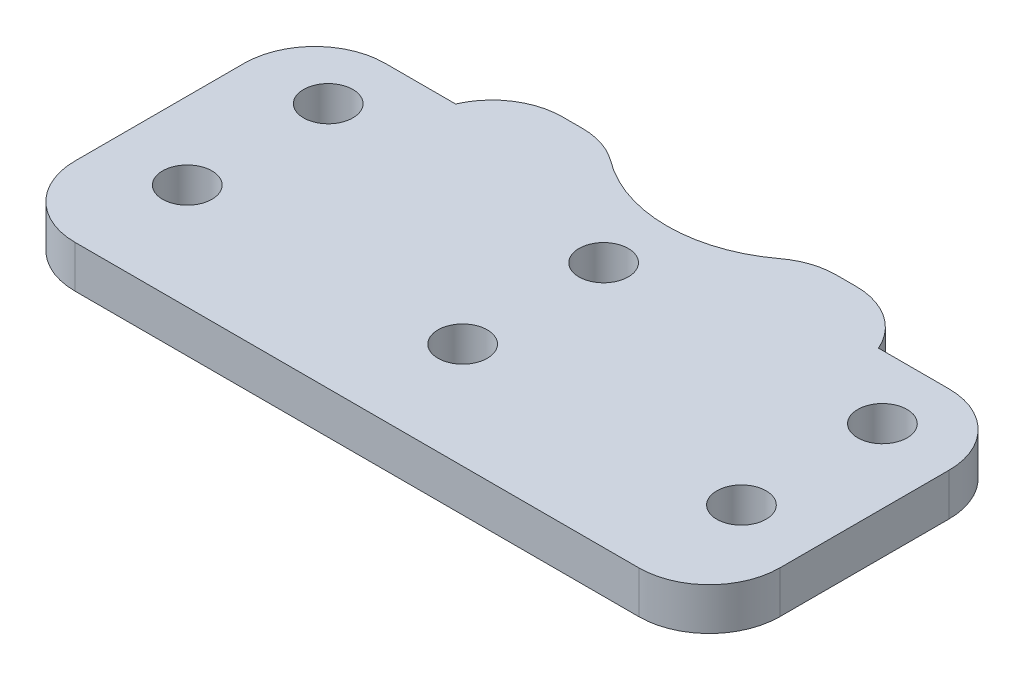
ISO-10303-21;
HEADER;
FILE_DESCRIPTION(('STEP AP214'),'2;1');
FILE_NAME('part.step','',(''),(''),'','','');
FILE_SCHEMA(('AUTOMOTIVE_DESIGN { 1 0 10303 214 1 1 1 1 }'));
ENDSEC;
DATA;
#1=APPLICATION_CONTEXT('core data for automotive mechanical design processes');
#2=APPLICATION_PROTOCOL_DEFINITION('international standard','automotive_design',2000,#1);
#3=PRODUCT_CONTEXT('',#1,'mechanical');
#4=PRODUCT('Part','Part','',(#3));
#5=PRODUCT_RELATED_PRODUCT_CATEGORY('part','',(#4));
#6=PRODUCT_DEFINITION_FORMATION('','',#4);
#7=PRODUCT_DEFINITION_CONTEXT('part definition',#1,'design');
#8=PRODUCT_DEFINITION('design','',#6,#7);
#9=PRODUCT_DEFINITION_SHAPE('','',#8);
#10=(LENGTH_UNIT() NAMED_UNIT(*) SI_UNIT(.MILLI.,.METRE.));
#11=(NAMED_UNIT(*) PLANE_ANGLE_UNIT() SI_UNIT($,.RADIAN.));
#12=(NAMED_UNIT(*) SI_UNIT($,.STERADIAN.) SOLID_ANGLE_UNIT());
#13=UNCERTAINTY_MEASURE_WITH_UNIT(LENGTH_MEASURE(1.E-05),#10,'distance_accuracy_value','');
#14=(GEOMETRIC_REPRESENTATION_CONTEXT(3) GLOBAL_UNCERTAINTY_ASSIGNED_CONTEXT((#13)) GLOBAL_UNIT_ASSIGNED_CONTEXT((#10,
#11,#12)) REPRESENTATION_CONTEXT('',''));
#15=CARTESIAN_POINT('',(0.,0.,0.));
#16=DIRECTION('',(0.,0.,1.));
#17=DIRECTION('',(1.,0.,0.));
#18=AXIS2_PLACEMENT_3D('',#15,#16,#17);
#19=CARTESIAN_POINT('',(0.,3.,-25.));
#20=DIRECTION('',(0.,0.,1.));
#21=DIRECTION('',(1.,0.,0.));
#22=AXIS2_PLACEMENT_3D('',#19,#20,#21);
#23=PLANE('',#22);
#24=DIRECTION('',(-1.,0.,0.));
#25=VECTOR('',#24,1.);
#26=CARTESIAN_POINT('',(0.,0.,-25.));
#27=LINE('',#26,#25);
#28=CARTESIAN_POINT('',(35.4174243050442,0.,-25.));
#29=VERTEX_POINT('',#28);
#30=CARTESIAN_POINT('',(34.,0.,-25.));
#31=VERTEX_POINT('',#30);
#32=EDGE_CURVE('E229',#29,#31,#27,.T.);
#33=ORIENTED_EDGE('',*,*,#32,.T.);
#34=DIRECTION('',(0.,1.,0.));
#35=VECTOR('',#34,1.);
#36=CARTESIAN_POINT('',(34.,3.,-25.));
#37=LINE('',#36,#35);
#38=CARTESIAN_POINT('',(34.,3.,-25.));
#39=VERTEX_POINT('',#38);
#40=EDGE_CURVE('E250',#31,#39,#37,.T.);
#41=ORIENTED_EDGE('',*,*,#40,.T.);
#42=DIRECTION('',(-1.,0.,0.));
#43=VECTOR('',#42,1.);
#44=CARTESIAN_POINT('',(0.,3.,-25.));
#45=LINE('',#44,#43);
#46=CARTESIAN_POINT('',(35.4174243050442,3.,-25.));
#47=VERTEX_POINT('',#46);
#48=EDGE_CURVE('E236',#47,#39,#45,.T.);
#49=ORIENTED_EDGE('',*,*,#48,.F.);
#50=DIRECTION('',(0.,1.,0.));
#51=VECTOR('',#50,1.);
#52=CARTESIAN_POINT('',(35.4174243050442,3.,-25.));
#53=LINE('',#52,#51);
#54=EDGE_CURVE('E247',#47,#29,#53,.F.);
#55=ORIENTED_EDGE('',*,*,#54,.T.);
#56=EDGE_LOOP('',(#33,#41,#49,#55));
#57=FACE_BOUND('',#56,.T.);
#58=ADVANCED_FACE('F32',(#57),#23,.F.);
#59=CARTESIAN_POINT('',(0.,3.,0.));
#60=DIRECTION('',(0.,-1.,0.));
#61=DIRECTION('',(0.,0.,-1.));
#62=AXIS2_PLACEMENT_3D('',#59,#60,#61);
#63=PLANE('',#62);
#64=ORIENTED_EDGE('',*,*,#48,.T.);
#65=CARTESIAN_POINT('',(34.,3.,-20.));
#66=DIRECTION('',(0.,-1.,0.));
#67=DIRECTION('',(0.,0.,-1.));
#68=AXIS2_PLACEMENT_3D('',#65,#66,#67);
#69=CIRCLE('',#68,5.);
#70=CARTESIAN_POINT('',(31.,3.,-24.));
#71=VERTEX_POINT('',#70);
#72=EDGE_CURVE('E263',#39,#71,#69,.F.);
#73=ORIENTED_EDGE('',*,*,#72,.T.);
#74=CARTESIAN_POINT('',(25.,3.,-32.));
#75=DIRECTION('',(0.,1.,0.));
#76=DIRECTION('',(0.,0.,1.));
#77=AXIS2_PLACEMENT_3D('',#74,#75,#76);
#78=CIRCLE('',#77,10.);
#79=CARTESIAN_POINT('',(19.,3.,-24.));
#80=VERTEX_POINT('',#79);
#81=EDGE_CURVE('E180',#80,#71,#78,.T.);
#82=ORIENTED_EDGE('',*,*,#81,.F.);
#83=CARTESIAN_POINT('',(16.,3.,-20.));
#84=DIRECTION('',(0.,-1.,0.));
#85=DIRECTION('',(0.,0.,-1.));
#86=AXIS2_PLACEMENT_3D('',#83,#84,#85);
#87=CIRCLE('',#86,5.);
#88=CARTESIAN_POINT('',(16.,3.,-25.));
#89=VERTEX_POINT('',#88);
#90=EDGE_CURVE('E261',#80,#89,#87,.F.);
#91=ORIENTED_EDGE('',*,*,#90,.T.);
#92=CARTESIAN_POINT('',(14.5825756949558,3.,-25.));
#93=VERTEX_POINT('',#92);
#94=EDGE_CURVE('E152',#89,#93,#45,.T.);
#95=ORIENTED_EDGE('',*,*,#94,.T.);
#96=CARTESIAN_POINT('',(14.5825756949558,3.,-20.));
#97=DIRECTION('',(0.,-1.,0.));
#98=DIRECTION('',(0.,0.,-1.));
#99=AXIS2_PLACEMENT_3D('',#96,#97,#98);
#100=CIRCLE('',#99,5.);
#101=CARTESIAN_POINT('',(10.,3.,-22.));
#102=VERTEX_POINT('',#101);
#103=EDGE_CURVE('E145',#93,#102,#100,.F.);
#104=ORIENTED_EDGE('',*,*,#103,.T.);
#105=DIRECTION('',(1.,0.,0.));
#106=VECTOR('',#105,1.);
#107=CARTESIAN_POINT('',(0.,3.,-22.));
#108=LINE('',#107,#106);
#109=CARTESIAN_POINT('',(5.,3.,-22.));
#110=VERTEX_POINT('',#109);
#111=EDGE_CURVE('E150',#110,#102,#108,.T.);
#112=ORIENTED_EDGE('',*,*,#111,.F.);
#113=CARTESIAN_POINT('',(5.,3.,-17.));
#114=DIRECTION('',(0.,-1.,0.));
#115=DIRECTION('',(0.,0.,-1.));
#116=AXIS2_PLACEMENT_3D('',#113,#114,#115);
#117=CIRCLE('',#116,5.);
#118=CARTESIAN_POINT('',(0.,3.,-17.));
#119=VERTEX_POINT('',#118);
#120=EDGE_CURVE('E158',#110,#119,#117,.F.);
#121=ORIENTED_EDGE('',*,*,#120,.T.);
#122=DIRECTION('',(0.,0.,1.));
#123=VECTOR('',#122,1.);
#124=CARTESIAN_POINT('',(0.,3.,0.));
#125=LINE('',#124,#123);
#126=CARTESIAN_POINT('',(0.,3.,-5.));
#127=VERTEX_POINT('',#126);
#128=EDGE_CURVE('E225',#119,#127,#125,.T.);
#129=ORIENTED_EDGE('',*,*,#128,.T.);
#130=CARTESIAN_POINT('',(5.,3.,-5.));
#131=DIRECTION('',(0.,-1.,0.));
#132=DIRECTION('',(0.,0.,-1.));
#133=AXIS2_PLACEMENT_3D('',#130,#131,#132);
#134=CIRCLE('',#133,5.);
#135=CARTESIAN_POINT('',(5.,3.,0.));
#136=VERTEX_POINT('',#135);
#137=EDGE_CURVE('E253',#127,#136,#134,.F.);
#138=ORIENTED_EDGE('',*,*,#137,.T.);
#139=DIRECTION('',(1.,0.,0.));
#140=VECTOR('',#139,1.);
#141=CARTESIAN_POINT('',(0.,3.,0.));
#142=LINE('',#141,#140);
#143=CARTESIAN_POINT('',(45.,3.,0.));
#144=VERTEX_POINT('',#143);
#145=EDGE_CURVE('E228',#136,#144,#142,.T.);
#146=ORIENTED_EDGE('',*,*,#145,.T.);
#147=CARTESIAN_POINT('',(45.,3.,-5.));
#148=DIRECTION('',(0.,-1.,0.));
#149=DIRECTION('',(0.,0.,-1.));
#150=AXIS2_PLACEMENT_3D('',#147,#148,#149);
#151=CIRCLE('',#150,5.);
#152=CARTESIAN_POINT('',(50.,3.,-5.));
#153=VERTEX_POINT('',#152);
#154=EDGE_CURVE('E255',#144,#153,#151,.F.);
#155=ORIENTED_EDGE('',*,*,#154,.T.);
#156=DIRECTION('',(0.,0.,-1.));
#157=VECTOR('',#156,1.);
#158=CARTESIAN_POINT('',(50.,3.,0.));
#159=LINE('',#158,#157);
#160=CARTESIAN_POINT('',(50.,3.,-17.));
#161=VERTEX_POINT('',#160);
#162=EDGE_CURVE('E232',#153,#161,#159,.T.);
#163=ORIENTED_EDGE('',*,*,#162,.T.);
#164=CARTESIAN_POINT('',(45.,3.,-17.));
#165=DIRECTION('',(0.,-1.,0.));
#166=DIRECTION('',(0.,0.,-1.));
#167=AXIS2_PLACEMENT_3D('',#164,#165,#166);
#168=CIRCLE('',#167,5.);
#169=CARTESIAN_POINT('',(45.,3.,-22.));
#170=VERTEX_POINT('',#169);
#171=EDGE_CURVE('E259',#161,#170,#168,.F.);
#172=ORIENTED_EDGE('',*,*,#171,.T.);
#173=DIRECTION('',(1.,0.,0.));
#174=VECTOR('',#173,1.);
#175=CARTESIAN_POINT('',(50.,3.,-22.));
#176=LINE('',#175,#174);
#177=CARTESIAN_POINT('',(40.,3.,-22.));
#178=VERTEX_POINT('',#177);
#179=EDGE_CURVE('E177',#178,#170,#176,.T.);
#180=ORIENTED_EDGE('',*,*,#179,.F.);
#181=CARTESIAN_POINT('',(35.4174243050442,3.,-20.));
#182=DIRECTION('',(0.,-1.,0.));
#183=DIRECTION('',(0.,0.,-1.));
#184=AXIS2_PLACEMENT_3D('',#181,#182,#183);
#185=CIRCLE('',#184,5.);
#186=EDGE_CURVE('E157',#178,#47,#185,.F.);
#187=ORIENTED_EDGE('',*,*,#186,.T.);
#188=EDGE_LOOP('',(#64,#73,#82,#91,#95,#104,#112,#121,#129,#138,#146,#155,#163,#172,#180,#187));
#189=FACE_BOUND('',#188,.T.);
#190=CARTESIAN_POINT('',(25.,3.,-17.5));
#191=DIRECTION('',(0.,1.,0.));
#192=DIRECTION('',(0.,0.,1.));
#193=AXIS2_PLACEMENT_3D('',#190,#191,#192);
#194=CIRCLE('',#193,1.75);
#195=CARTESIAN_POINT('',(25.,3.,-15.75));
#196=VERTEX_POINT('',#195);
#197=EDGE_CURVE('E219',#196,#196,#194,.T.);
#198=ORIENTED_EDGE('',*,*,#197,.F.);
#199=EDGE_LOOP('',(#198));
#200=FACE_BOUND('',#199,.T.);
#201=CARTESIAN_POINT('',(25.,3.,-7.5));
#202=DIRECTION('',(0.,1.,0.));
#203=DIRECTION('',(0.,0.,1.));
#204=AXIS2_PLACEMENT_3D('',#201,#202,#203);
#205=CIRCLE('',#204,1.75);
#206=CARTESIAN_POINT('',(25.,3.,-5.75));
#207=VERTEX_POINT('',#206);
#208=EDGE_CURVE('E213',#207,#207,#205,.T.);
#209=ORIENTED_EDGE('',*,*,#208,.F.);
#210=EDGE_LOOP('',(#209));
#211=FACE_BOUND('',#210,.T.);
#212=CARTESIAN_POINT('',(5.46323670634306,3.,-17.5));
#213=DIRECTION('',(0.,1.,0.));
#214=DIRECTION('',(0.,0.,1.));
#215=AXIS2_PLACEMENT_3D('',#212,#213,#214);
#216=CIRCLE('',#215,1.75);
#217=CARTESIAN_POINT('',(5.46323670634306,3.,-15.75));
#218=VERTEX_POINT('',#217);
#219=EDGE_CURVE('E207',#218,#218,#216,.T.);
#220=ORIENTED_EDGE('',*,*,#219,.F.);
#221=EDGE_LOOP('',(#220));
#222=FACE_BOUND('',#221,.T.);
#223=CARTESIAN_POINT('',(5.46323670634306,3.,-7.5));
#224=DIRECTION('',(0.,1.,0.));
#225=DIRECTION('',(0.,0.,1.));
#226=AXIS2_PLACEMENT_3D('',#223,#224,#225);
#227=CIRCLE('',#226,1.75);
#228=CARTESIAN_POINT('',(5.46323670634306,3.,-5.75));
#229=VERTEX_POINT('',#228);
#230=EDGE_CURVE('E201',#229,#229,#227,.T.);
#231=ORIENTED_EDGE('',*,*,#230,.F.);
#232=EDGE_LOOP('',(#231));
#233=FACE_BOUND('',#232,.T.);
#234=CARTESIAN_POINT('',(44.7775700267946,3.,-7.5));
#235=DIRECTION('',(0.,1.,0.));
#236=DIRECTION('',(0.,0.,1.));
#237=AXIS2_PLACEMENT_3D('',#234,#235,#236);
#238=CIRCLE('',#237,1.75);
#239=CARTESIAN_POINT('',(44.7775700267946,3.,-5.75));
#240=VERTEX_POINT('',#239);
#241=EDGE_CURVE('E195',#240,#240,#238,.T.);
#242=ORIENTED_EDGE('',*,*,#241,.F.);
#243=EDGE_LOOP('',(#242));
#244=FACE_BOUND('',#243,.T.);
#245=CARTESIAN_POINT('',(44.7775700267946,3.,-17.5));
#246=DIRECTION('',(0.,1.,0.));
#247=DIRECTION('',(0.,0.,1.));
#248=AXIS2_PLACEMENT_3D('',#245,#246,#247);
#249=CIRCLE('',#248,1.75);
#250=CARTESIAN_POINT('',(44.7775700267946,3.,-15.75));
#251=VERTEX_POINT('',#250);
#252=EDGE_CURVE('E189',#251,#251,#249,.T.);
#253=ORIENTED_EDGE('',*,*,#252,.F.);
#254=EDGE_LOOP('',(#253));
#255=FACE_BOUND('',#254,.T.);
#256=ADVANCED_FACE('F148',(#189,#200,#211,#222,#233,#244,#255),#63,.F.);
#257=CARTESIAN_POINT('',(0.,0.,0.));
#258=DIRECTION('',(0.,-1.,0.));
#259=DIRECTION('',(0.,0.,-1.));
#260=AXIS2_PLACEMENT_3D('',#257,#258,#259);
#261=PLANE('',#260);
#262=CARTESIAN_POINT('',(25.,0.,-32.));
#263=DIRECTION('',(0.,-1.,0.));
#264=DIRECTION('',(0.,0.,-1.));
#265=AXIS2_PLACEMENT_3D('',#262,#263,#264);
#266=CIRCLE('',#265,10.);
#267=CARTESIAN_POINT('',(31.,0.,-24.));
#268=VERTEX_POINT('',#267);
#269=CARTESIAN_POINT('',(19.,0.,-24.));
#270=VERTEX_POINT('',#269);
#271=EDGE_CURVE('E171',#268,#270,#266,.T.);
#272=ORIENTED_EDGE('',*,*,#271,.F.);
#273=CARTESIAN_POINT('',(34.,0.,-20.));
#274=DIRECTION('',(0.,-1.,0.));
#275=DIRECTION('',(0.,0.,-1.));
#276=AXIS2_PLACEMENT_3D('',#273,#274,#275);
#277=CIRCLE('',#276,5.);
#278=EDGE_CURVE('E280',#268,#31,#277,.T.);
#279=ORIENTED_EDGE('',*,*,#278,.T.);
#280=ORIENTED_EDGE('',*,*,#32,.F.);
#281=CARTESIAN_POINT('',(35.4174243050442,0.,-20.));
#282=DIRECTION('',(0.,-1.,0.));
#283=DIRECTION('',(0.,0.,-1.));
#284=AXIS2_PLACEMENT_3D('',#281,#282,#283);
#285=CIRCLE('',#284,5.);
#286=CARTESIAN_POINT('',(40.,0.,-22.));
#287=VERTEX_POINT('',#286);
#288=EDGE_CURVE('E274',#29,#287,#285,.T.);
#289=ORIENTED_EDGE('',*,*,#288,.T.);
#290=DIRECTION('',(-1.,0.,0.));
#291=VECTOR('',#290,1.);
#292=CARTESIAN_POINT('',(0.,0.,-22.));
#293=LINE('',#292,#291);
#294=CARTESIAN_POINT('',(45.,0.,-22.));
#295=VERTEX_POINT('',#294);
#296=EDGE_CURVE('E174',#295,#287,#293,.T.);
#297=ORIENTED_EDGE('',*,*,#296,.F.);
#298=CARTESIAN_POINT('',(45.,0.,-17.));
#299=DIRECTION('',(0.,-1.,0.));
#300=DIRECTION('',(0.,0.,-1.));
#301=AXIS2_PLACEMENT_3D('',#298,#299,#300);
#302=CIRCLE('',#301,5.);
#303=CARTESIAN_POINT('',(50.,0.,-17.));
#304=VERTEX_POINT('',#303);
#305=EDGE_CURVE('E276',#295,#304,#302,.T.);
#306=ORIENTED_EDGE('',*,*,#305,.T.);
#307=DIRECTION('',(0.,0.,-1.));
#308=VECTOR('',#307,1.);
#309=CARTESIAN_POINT('',(50.,0.,0.));
#310=LINE('',#309,#308);
#311=CARTESIAN_POINT('',(50.,0.,-5.));
#312=VERTEX_POINT('',#311);
#313=EDGE_CURVE('E241',#312,#304,#310,.T.);
#314=ORIENTED_EDGE('',*,*,#313,.F.);
#315=CARTESIAN_POINT('',(45.,0.,-5.));
#316=DIRECTION('',(0.,-1.,0.));
#317=DIRECTION('',(0.,0.,-1.));
#318=AXIS2_PLACEMENT_3D('',#315,#316,#317);
#319=CIRCLE('',#318,5.);
#320=CARTESIAN_POINT('',(45.,0.,0.));
#321=VERTEX_POINT('',#320);
#322=EDGE_CURVE('E270',#312,#321,#319,.T.);
#323=ORIENTED_EDGE('',*,*,#322,.T.);
#324=DIRECTION('',(1.,0.,0.));
#325=VECTOR('',#324,1.);
#326=CARTESIAN_POINT('',(0.,0.,0.));
#327=LINE('',#326,#325);
#328=CARTESIAN_POINT('',(5.,0.,0.));
#329=VERTEX_POINT('',#328);
#330=EDGE_CURVE('E238',#329,#321,#327,.T.);
#331=ORIENTED_EDGE('',*,*,#330,.F.);
#332=CARTESIAN_POINT('',(5.,0.,-5.));
#333=DIRECTION('',(0.,-1.,0.));
#334=DIRECTION('',(0.,0.,-1.));
#335=AXIS2_PLACEMENT_3D('',#332,#333,#334);
#336=CIRCLE('',#335,5.);
#337=CARTESIAN_POINT('',(0.,0.,-5.));
#338=VERTEX_POINT('',#337);
#339=EDGE_CURVE('E53',#329,#338,#336,.T.);
#340=ORIENTED_EDGE('',*,*,#339,.T.);
#341=DIRECTION('',(0.,0.,1.));
#342=VECTOR('',#341,1.);
#343=CARTESIAN_POINT('',(0.,0.,0.));
#344=LINE('',#343,#342);
#345=CARTESIAN_POINT('',(0.,0.,-17.));
#346=VERTEX_POINT('',#345);
#347=EDGE_CURVE('E222',#346,#338,#344,.T.);
#348=ORIENTED_EDGE('',*,*,#347,.F.);
#349=CARTESIAN_POINT('',(5.,0.,-17.));
#350=DIRECTION('',(0.,-1.,0.));
#351=DIRECTION('',(0.,0.,-1.));
#352=AXIS2_PLACEMENT_3D('',#349,#350,#351);
#353=CIRCLE('',#352,5.);
#354=CARTESIAN_POINT('',(5.,0.,-22.));
#355=VERTEX_POINT('',#354);
#356=EDGE_CURVE('E47',#346,#355,#353,.T.);
#357=ORIENTED_EDGE('',*,*,#356,.T.);
#358=DIRECTION('',(-1.,0.,0.));
#359=VECTOR('',#358,1.);
#360=CARTESIAN_POINT('',(0.,0.,-22.));
#361=LINE('',#360,#359);
#362=CARTESIAN_POINT('',(10.,0.,-22.));
#363=VERTEX_POINT('',#362);
#364=EDGE_CURVE('E186',#363,#355,#361,.T.);
#365=ORIENTED_EDGE('',*,*,#364,.F.);
#366=CARTESIAN_POINT('',(14.5825756949558,0.,-20.));
#367=DIRECTION('',(0.,-1.,0.));
#368=DIRECTION('',(0.,0.,-1.));
#369=AXIS2_PLACEMENT_3D('',#366,#367,#368);
#370=CIRCLE('',#369,5.);
#371=CARTESIAN_POINT('',(14.5825756949558,0.,-25.));
#372=VERTEX_POINT('',#371);
#373=EDGE_CURVE('E170',#363,#372,#370,.T.);
#374=ORIENTED_EDGE('',*,*,#373,.T.);
#375=CARTESIAN_POINT('',(16.,0.,-25.));
#376=VERTEX_POINT('',#375);
#377=EDGE_CURVE('E244',#376,#372,#27,.T.);
#378=ORIENTED_EDGE('',*,*,#377,.F.);
#379=CARTESIAN_POINT('',(16.,0.,-20.));
#380=DIRECTION('',(0.,-1.,0.));
#381=DIRECTION('',(0.,0.,-1.));
#382=AXIS2_PLACEMENT_3D('',#379,#380,#381);
#383=CIRCLE('',#382,5.);
#384=EDGE_CURVE('E278',#376,#270,#383,.T.);
#385=ORIENTED_EDGE('',*,*,#384,.T.);
#386=EDGE_LOOP('',(#272,#279,#280,#289,#297,#306,#314,#323,#331,#340,#348,#357,#365,#374,#378,#385));
#387=FACE_BOUND('',#386,.T.);
#388=CARTESIAN_POINT('',(44.7775700267946,0.,-7.5));
#389=DIRECTION('',(0.,1.,0.));
#390=DIRECTION('',(0.,0.,1.));
#391=AXIS2_PLACEMENT_3D('',#388,#389,#390);
#392=CIRCLE('',#391,1.75);
#393=CARTESIAN_POINT('',(44.7775700267946,0.,-5.75));
#394=VERTEX_POINT('',#393);
#395=EDGE_CURVE('E192',#394,#394,#392,.T.);
#396=ORIENTED_EDGE('',*,*,#395,.T.);
#397=EDGE_LOOP('',(#396));
#398=FACE_BOUND('',#397,.T.);
#399=CARTESIAN_POINT('',(5.46323670634306,0.,-17.5));
#400=DIRECTION('',(0.,1.,0.));
#401=DIRECTION('',(0.,0.,1.));
#402=AXIS2_PLACEMENT_3D('',#399,#400,#401);
#403=CIRCLE('',#402,1.75);
#404=CARTESIAN_POINT('',(5.46323670634306,0.,-15.75));
#405=VERTEX_POINT('',#404);
#406=EDGE_CURVE('E204',#405,#405,#403,.T.);
#407=ORIENTED_EDGE('',*,*,#406,.T.);
#408=EDGE_LOOP('',(#407));
#409=FACE_BOUND('',#408,.T.);
#410=CARTESIAN_POINT('',(25.,0.,-17.5));
#411=DIRECTION('',(0.,1.,0.));
#412=DIRECTION('',(0.,0.,1.));
#413=AXIS2_PLACEMENT_3D('',#410,#411,#412);
#414=CIRCLE('',#413,1.75);
#415=CARTESIAN_POINT('',(25.,0.,-15.75));
#416=VERTEX_POINT('',#415);
#417=EDGE_CURVE('E216',#416,#416,#414,.T.);
#418=ORIENTED_EDGE('',*,*,#417,.T.);
#419=EDGE_LOOP('',(#418));
#420=FACE_BOUND('',#419,.T.);
#421=CARTESIAN_POINT('',(25.,0.,-7.5));
#422=DIRECTION('',(0.,1.,0.));
#423=DIRECTION('',(0.,0.,1.));
#424=AXIS2_PLACEMENT_3D('',#421,#422,#423);
#425=CIRCLE('',#424,1.75);
#426=CARTESIAN_POINT('',(25.,0.,-5.75));
#427=VERTEX_POINT('',#426);
#428=EDGE_CURVE('E210',#427,#427,#425,.T.);
#429=ORIENTED_EDGE('',*,*,#428,.T.);
#430=EDGE_LOOP('',(#429));
#431=FACE_BOUND('',#430,.T.);
#432=CARTESIAN_POINT('',(5.46323670634306,0.,-7.5));
#433=DIRECTION('',(0.,1.,0.));
#434=DIRECTION('',(0.,0.,1.));
#435=AXIS2_PLACEMENT_3D('',#432,#433,#434);
#436=CIRCLE('',#435,1.75);
#437=CARTESIAN_POINT('',(5.46323670634306,0.,-5.75));
#438=VERTEX_POINT('',#437);
#439=EDGE_CURVE('E198',#438,#438,#436,.T.);
#440=ORIENTED_EDGE('',*,*,#439,.T.);
#441=EDGE_LOOP('',(#440));
#442=FACE_BOUND('',#441,.T.);
#443=CARTESIAN_POINT('',(44.7775700267946,0.,-17.5));
#444=DIRECTION('',(0.,1.,0.));
#445=DIRECTION('',(0.,0.,1.));
#446=AXIS2_PLACEMENT_3D('',#443,#444,#445);
#447=CIRCLE('',#446,1.75);
#448=CARTESIAN_POINT('',(44.7775700267946,0.,-15.75));
#449=VERTEX_POINT('',#448);
#450=EDGE_CURVE('E188',#449,#449,#447,.T.);
#451=ORIENTED_EDGE('',*,*,#450,.T.);
#452=EDGE_LOOP('',(#451));
#453=FACE_BOUND('',#452,.T.);
#454=ADVANCED_FACE('F308',(#387,#398,#409,#420,#431,#442,#453),#261,.T.);
#455=CARTESIAN_POINT('',(0.,3.,0.));
#456=DIRECTION('',(1.,0.,0.));
#457=DIRECTION('',(0.,0.,-1.));
#458=AXIS2_PLACEMENT_3D('',#455,#456,#457);
#459=PLANE('',#458);
#460=ORIENTED_EDGE('',*,*,#128,.F.);
#461=DIRECTION('',(0.,1.,0.));
#462=VECTOR('',#461,1.);
#463=CARTESIAN_POINT('',(0.,3.,-17.));
#464=LINE('',#463,#462);
#465=EDGE_CURVE('E298',#119,#346,#464,.F.);
#466=ORIENTED_EDGE('',*,*,#465,.T.);
#467=ORIENTED_EDGE('',*,*,#347,.T.);
#468=DIRECTION('',(0.,-1.,0.));
#469=VECTOR('',#468,1.);
#470=CARTESIAN_POINT('',(0.,3.,-5.));
#471=LINE('',#470,#469);
#472=EDGE_CURVE('E296',#338,#127,#471,.F.);
#473=ORIENTED_EDGE('',*,*,#472,.T.);
#474=EDGE_LOOP('',(#460,#466,#467,#473));
#475=FACE_BOUND('',#474,.T.);
#476=ADVANCED_FACE('F323',(#475),#459,.F.);
#477=CARTESIAN_POINT('',(0.,3.,0.));
#478=DIRECTION('',(0.,0.,-1.));
#479=DIRECTION('',(-1.,0.,0.));
#480=AXIS2_PLACEMENT_3D('',#477,#478,#479);
#481=PLANE('',#480);
#482=ORIENTED_EDGE('',*,*,#330,.T.);
#483=DIRECTION('',(0.,-1.,0.));
#484=VECTOR('',#483,1.);
#485=CARTESIAN_POINT('',(45.,3.,0.));
#486=LINE('',#485,#484);
#487=EDGE_CURVE('E11',#321,#144,#486,.F.);
#488=ORIENTED_EDGE('',*,*,#487,.T.);
#489=ORIENTED_EDGE('',*,*,#145,.F.);
#490=DIRECTION('',(0.,-1.,0.));
#491=VECTOR('',#490,1.);
#492=CARTESIAN_POINT('',(5.,3.,0.));
#493=LINE('',#492,#491);
#494=EDGE_CURVE('E40',#136,#329,#493,.T.);
#495=ORIENTED_EDGE('',*,*,#494,.T.);
#496=EDGE_LOOP('',(#482,#488,#489,#495));
#497=FACE_BOUND('',#496,.T.);
#498=ADVANCED_FACE('F303',(#497),#481,.F.);
#499=CARTESIAN_POINT('',(50.,3.,0.));
#500=DIRECTION('',(-1.,0.,0.));
#501=DIRECTION('',(0.,0.,1.));
#502=AXIS2_PLACEMENT_3D('',#499,#500,#501);
#503=PLANE('',#502);
#504=ORIENTED_EDGE('',*,*,#313,.T.);
#505=DIRECTION('',(0.,1.,0.));
#506=VECTOR('',#505,1.);
#507=CARTESIAN_POINT('',(50.,3.,-17.));
#508=LINE('',#507,#506);
#509=EDGE_CURVE('E290',#304,#161,#508,.T.);
#510=ORIENTED_EDGE('',*,*,#509,.T.);
#511=ORIENTED_EDGE('',*,*,#162,.F.);
#512=DIRECTION('',(0.,-1.,0.));
#513=VECTOR('',#512,1.);
#514=CARTESIAN_POINT('',(50.,3.,-5.));
#515=LINE('',#514,#513);
#516=EDGE_CURVE('E287',#153,#312,#515,.T.);
#517=ORIENTED_EDGE('',*,*,#516,.T.);
#518=EDGE_LOOP('',(#504,#510,#511,#517));
#519=FACE_BOUND('',#518,.T.);
#520=ADVANCED_FACE('F317',(#519),#503,.F.);
#521=ORIENTED_EDGE('',*,*,#94,.F.);
#522=DIRECTION('',(0.,1.,0.));
#523=VECTOR('',#522,1.);
#524=CARTESIAN_POINT('',(16.,3.,-25.));
#525=LINE('',#524,#523);
#526=EDGE_CURVE('E284',#89,#376,#525,.F.);
#527=ORIENTED_EDGE('',*,*,#526,.T.);
#528=ORIENTED_EDGE('',*,*,#377,.T.);
#529=DIRECTION('',(0.,-1.,0.));
#530=VECTOR('',#529,1.);
#531=CARTESIAN_POINT('',(14.5825756949558,3.,-25.));
#532=LINE('',#531,#530);
#533=EDGE_CURVE('E282',#372,#93,#532,.F.);
#534=ORIENTED_EDGE('',*,*,#533,.T.);
#535=EDGE_LOOP('',(#521,#527,#528,#534));
#536=FACE_BOUND('',#535,.T.);
#537=ADVANCED_FACE('F338',(#536),#23,.F.);
#538=CARTESIAN_POINT('',(25.,3.,-17.5));
#539=DIRECTION('',(0.,-1.,0.));
#540=DIRECTION('',(0.,0.,-1.));
#541=AXIS2_PLACEMENT_3D('',#538,#539,#540);
#542=CYLINDRICAL_SURFACE('',#541,1.75);
#543=ORIENTED_EDGE('',*,*,#197,.T.);
#544=EDGE_LOOP('',(#543));
#545=FACE_BOUND('',#544,.T.);
#546=ORIENTED_EDGE('',*,*,#417,.F.);
#547=EDGE_LOOP('',(#546));
#548=FACE_BOUND('',#547,.T.);
#549=ADVANCED_FACE('F347',(#545,#548),#542,.F.);
#550=CARTESIAN_POINT('',(25.,3.,-7.5));
#551=DIRECTION('',(0.,-1.,0.));
#552=DIRECTION('',(0.,0.,-1.));
#553=AXIS2_PLACEMENT_3D('',#550,#551,#552);
#554=CYLINDRICAL_SURFACE('',#553,1.75);
#555=ORIENTED_EDGE('',*,*,#208,.T.);
#556=EDGE_LOOP('',(#555));
#557=FACE_BOUND('',#556,.T.);
#558=ORIENTED_EDGE('',*,*,#428,.F.);
#559=EDGE_LOOP('',(#558));
#560=FACE_BOUND('',#559,.T.);
#561=ADVANCED_FACE('F353',(#557,#560),#554,.F.);
#562=CARTESIAN_POINT('',(5.46323670634306,3.,-17.5));
#563=DIRECTION('',(0.,-1.,0.));
#564=DIRECTION('',(0.,0.,-1.));
#565=AXIS2_PLACEMENT_3D('',#562,#563,#564);
#566=CYLINDRICAL_SURFACE('',#565,1.75);
#567=ORIENTED_EDGE('',*,*,#219,.T.);
#568=EDGE_LOOP('',(#567));
#569=FACE_BOUND('',#568,.T.);
#570=ORIENTED_EDGE('',*,*,#406,.F.);
#571=EDGE_LOOP('',(#570));
#572=FACE_BOUND('',#571,.T.);
#573=ADVANCED_FACE('F497',(#569,#572),#566,.F.);
#574=CARTESIAN_POINT('',(5.46323670634306,3.,-7.5));
#575=DIRECTION('',(0.,-1.,0.));
#576=DIRECTION('',(0.,0.,-1.));
#577=AXIS2_PLACEMENT_3D('',#574,#575,#576);
#578=CYLINDRICAL_SURFACE('',#577,1.75);
#579=ORIENTED_EDGE('',*,*,#230,.T.);
#580=EDGE_LOOP('',(#579));
#581=FACE_BOUND('',#580,.T.);
#582=ORIENTED_EDGE('',*,*,#439,.F.);
#583=EDGE_LOOP('',(#582));
#584=FACE_BOUND('',#583,.T.);
#585=ADVANCED_FACE('F493',(#581,#584),#578,.F.);
#586=CARTESIAN_POINT('',(44.7775700267946,3.,-7.5));
#587=DIRECTION('',(0.,-1.,0.));
#588=DIRECTION('',(0.,0.,-1.));
#589=AXIS2_PLACEMENT_3D('',#586,#587,#588);
#590=CYLINDRICAL_SURFACE('',#589,1.75);
#591=ORIENTED_EDGE('',*,*,#241,.T.);
#592=EDGE_LOOP('',(#591));
#593=FACE_BOUND('',#592,.T.);
#594=ORIENTED_EDGE('',*,*,#395,.F.);
#595=EDGE_LOOP('',(#594));
#596=FACE_BOUND('',#595,.T.);
#597=ADVANCED_FACE('F489',(#593,#596),#590,.F.);
#598=CARTESIAN_POINT('',(44.7775700267946,3.,-17.5));
#599=DIRECTION('',(0.,-1.,0.));
#600=DIRECTION('',(0.,0.,-1.));
#601=AXIS2_PLACEMENT_3D('',#598,#599,#600);
#602=CYLINDRICAL_SURFACE('',#601,1.75);
#603=ORIENTED_EDGE('',*,*,#252,.T.);
#604=EDGE_LOOP('',(#603));
#605=FACE_BOUND('',#604,.T.);
#606=ORIENTED_EDGE('',*,*,#450,.F.);
#607=EDGE_LOOP('',(#606));
#608=FACE_BOUND('',#607,.T.);
#609=ADVANCED_FACE('F420',(#605,#608),#602,.F.);
#610=CARTESIAN_POINT('',(25.,-7.,-32.));
#611=DIRECTION('',(0.,1.,0.));
#612=DIRECTION('',(0.,0.,1.));
#613=AXIS2_PLACEMENT_3D('',#610,#611,#612);
#614=CYLINDRICAL_SURFACE('',#613,10.);
#615=ORIENTED_EDGE('',*,*,#81,.T.);
#616=DIRECTION('',(0.,1.,0.));
#617=VECTOR('',#616,1.);
#618=CARTESIAN_POINT('',(31.,-7.,-24.));
#619=LINE('',#618,#617);
#620=EDGE_CURVE('E267',#71,#268,#619,.F.);
#621=ORIENTED_EDGE('',*,*,#620,.T.);
#622=ORIENTED_EDGE('',*,*,#271,.T.);
#623=DIRECTION('',(0.,1.,0.));
#624=VECTOR('',#623,1.);
#625=CARTESIAN_POINT('',(19.,-7.,-24.));
#626=LINE('',#625,#624);
#627=EDGE_CURVE('E265',#270,#80,#626,.T.);
#628=ORIENTED_EDGE('',*,*,#627,.T.);
#629=EDGE_LOOP('',(#615,#621,#622,#628));
#630=FACE_BOUND('',#629,.T.);
#631=ADVANCED_FACE('F364',(#630),#614,.F.);
#632=CARTESIAN_POINT('',(50.,-7.,-22.));
#633=DIRECTION('',(0.,0.,1.));
#634=DIRECTION('',(1.,0.,0.));
#635=AXIS2_PLACEMENT_3D('',#632,#633,#634);
#636=PLANE('',#635);
#637=ORIENTED_EDGE('',*,*,#179,.T.);
#638=DIRECTION('',(0.,1.,0.));
#639=VECTOR('',#638,1.);
#640=CARTESIAN_POINT('',(45.,-7.,-22.));
#641=LINE('',#640,#639);
#642=EDGE_CURVE('E293',#170,#295,#641,.F.);
#643=ORIENTED_EDGE('',*,*,#642,.T.);
#644=ORIENTED_EDGE('',*,*,#296,.T.);
#645=DIRECTION('',(0.,1.,0.));
#646=VECTOR('',#645,1.);
#647=CARTESIAN_POINT('',(40.,-7.,-22.));
#648=LINE('',#647,#646);
#649=EDGE_CURVE('E166',#287,#178,#648,.T.);
#650=ORIENTED_EDGE('',*,*,#649,.T.);
#651=EDGE_LOOP('',(#637,#643,#644,#650));
#652=FACE_BOUND('',#651,.T.);
#653=ADVANCED_FACE('F379',(#652),#636,.F.);
#654=CARTESIAN_POINT('',(0.,-7.,-22.));
#655=DIRECTION('',(0.,0.,1.));
#656=DIRECTION('',(1.,0.,0.));
#657=AXIS2_PLACEMENT_3D('',#654,#655,#656);
#658=PLANE('',#657);
#659=ORIENTED_EDGE('',*,*,#364,.T.);
#660=DIRECTION('',(0.,1.,0.));
#661=VECTOR('',#660,1.);
#662=CARTESIAN_POINT('',(5.,-7.,-22.));
#663=LINE('',#662,#661);
#664=EDGE_CURVE('E165',#355,#110,#663,.T.);
#665=ORIENTED_EDGE('',*,*,#664,.T.);
#666=ORIENTED_EDGE('',*,*,#111,.T.);
#667=DIRECTION('',(0.,1.,0.));
#668=VECTOR('',#667,1.);
#669=CARTESIAN_POINT('',(10.,-7.,-22.));
#670=LINE('',#669,#668);
#671=EDGE_CURVE('E163',#363,#102,#670,.T.);
#672=ORIENTED_EDGE('',*,*,#671,.F.);
#673=EDGE_LOOP('',(#659,#665,#666,#672));
#674=FACE_BOUND('',#673,.T.);
#675=ADVANCED_FACE('F162',(#674),#658,.F.);
#676=CARTESIAN_POINT('',(34.,-7.,-20.));
#677=DIRECTION('',(0.,1.,0.));
#678=DIRECTION('',(0.,0.,1.));
#679=AXIS2_PLACEMENT_3D('',#676,#677,#678);
#680=CYLINDRICAL_SURFACE('',#679,5.);
#681=ORIENTED_EDGE('',*,*,#278,.F.);
#682=ORIENTED_EDGE('',*,*,#620,.F.);
#683=ORIENTED_EDGE('',*,*,#72,.F.);
#684=ORIENTED_EDGE('',*,*,#40,.F.);
#685=EDGE_LOOP('',(#681,#682,#683,#684));
#686=FACE_BOUND('',#685,.T.);
#687=ADVANCED_FACE('F368',(#686),#680,.T.);
#688=CARTESIAN_POINT('',(16.,-7.,-20.));
#689=DIRECTION('',(0.,1.,0.));
#690=DIRECTION('',(0.,0.,1.));
#691=AXIS2_PLACEMENT_3D('',#688,#689,#690);
#692=CYLINDRICAL_SURFACE('',#691,5.);
#693=ORIENTED_EDGE('',*,*,#90,.F.);
#694=ORIENTED_EDGE('',*,*,#627,.F.);
#695=ORIENTED_EDGE('',*,*,#384,.F.);
#696=ORIENTED_EDGE('',*,*,#526,.F.);
#697=EDGE_LOOP('',(#693,#694,#695,#696));
#698=FACE_BOUND('',#697,.T.);
#699=ADVANCED_FACE('F360',(#698),#692,.T.);
#700=CARTESIAN_POINT('',(45.,3.,-17.));
#701=DIRECTION('',(0.,1.,0.));
#702=DIRECTION('',(0.,0.,1.));
#703=AXIS2_PLACEMENT_3D('',#700,#701,#702);
#704=CYLINDRICAL_SURFACE('',#703,5.);
#705=ORIENTED_EDGE('',*,*,#305,.F.);
#706=ORIENTED_EDGE('',*,*,#642,.F.);
#707=ORIENTED_EDGE('',*,*,#171,.F.);
#708=ORIENTED_EDGE('',*,*,#509,.F.);
#709=EDGE_LOOP('',(#705,#706,#707,#708));
#710=FACE_BOUND('',#709,.T.);
#711=ADVANCED_FACE('F382',(#710),#704,.T.);
#712=CARTESIAN_POINT('',(35.4174243050442,-7.,-20.));
#713=DIRECTION('',(0.,1.,0.));
#714=DIRECTION('',(0.,0.,1.));
#715=AXIS2_PLACEMENT_3D('',#712,#713,#714);
#716=CYLINDRICAL_SURFACE('',#715,5.);
#717=ORIENTED_EDGE('',*,*,#186,.F.);
#718=ORIENTED_EDGE('',*,*,#649,.F.);
#719=ORIENTED_EDGE('',*,*,#288,.F.);
#720=ORIENTED_EDGE('',*,*,#54,.F.);
#721=EDGE_LOOP('',(#717,#718,#719,#720));
#722=FACE_BOUND('',#721,.T.);
#723=ADVANCED_FACE('F333',(#722),#716,.T.);
#724=CARTESIAN_POINT('',(14.5825756949558,-7.,-20.));
#725=DIRECTION('',(0.,-1.,0.));
#726=DIRECTION('',(0.,0.,-1.));
#727=AXIS2_PLACEMENT_3D('',#724,#725,#726);
#728=CYLINDRICAL_SURFACE('',#727,5.);
#729=ORIENTED_EDGE('',*,*,#373,.F.);
#730=ORIENTED_EDGE('',*,*,#671,.T.);
#731=ORIENTED_EDGE('',*,*,#103,.F.);
#732=ORIENTED_EDGE('',*,*,#533,.F.);
#733=EDGE_LOOP('',(#729,#730,#731,#732));
#734=FACE_BOUND('',#733,.T.);
#735=ADVANCED_FACE('F169',(#734),#728,.T.);
#736=CARTESIAN_POINT('',(5.,-7.,-17.));
#737=DIRECTION('',(0.,1.,0.));
#738=DIRECTION('',(0.,0.,1.));
#739=AXIS2_PLACEMENT_3D('',#736,#737,#738);
#740=CYLINDRICAL_SURFACE('',#739,5.);
#741=ORIENTED_EDGE('',*,*,#356,.F.);
#742=ORIENTED_EDGE('',*,*,#465,.F.);
#743=ORIENTED_EDGE('',*,*,#120,.F.);
#744=ORIENTED_EDGE('',*,*,#664,.F.);
#745=EDGE_LOOP('',(#741,#742,#743,#744));
#746=FACE_BOUND('',#745,.T.);
#747=ADVANCED_FACE('F326',(#746),#740,.T.);
#748=CARTESIAN_POINT('',(45.,3.,-5.));
#749=DIRECTION('',(0.,-1.,0.));
#750=DIRECTION('',(0.,0.,-1.));
#751=AXIS2_PLACEMENT_3D('',#748,#749,#750);
#752=CYLINDRICAL_SURFACE('',#751,5.);
#753=ORIENTED_EDGE('',*,*,#154,.F.);
#754=ORIENTED_EDGE('',*,*,#487,.F.);
#755=ORIENTED_EDGE('',*,*,#322,.F.);
#756=ORIENTED_EDGE('',*,*,#516,.F.);
#757=EDGE_LOOP('',(#753,#754,#755,#756));
#758=FACE_BOUND('',#757,.T.);
#759=ADVANCED_FACE('F314',(#758),#752,.T.);
#760=CARTESIAN_POINT('',(5.,3.,-5.));
#761=DIRECTION('',(0.,-1.,0.));
#762=DIRECTION('',(0.,0.,-1.));
#763=AXIS2_PLACEMENT_3D('',#760,#761,#762);
#764=CYLINDRICAL_SURFACE('',#763,5.);
#765=ORIENTED_EDGE('',*,*,#137,.F.);
#766=ORIENTED_EDGE('',*,*,#472,.F.);
#767=ORIENTED_EDGE('',*,*,#339,.F.);
#768=ORIENTED_EDGE('',*,*,#494,.F.);
#769=EDGE_LOOP('',(#765,#766,#767,#768));
#770=FACE_BOUND('',#769,.T.);
#771=ADVANCED_FACE('F34',(#770),#764,.T.);
#772=CLOSED_SHELL('',(#58,#256,#454,#476,#498,#520,#537,#549,#561,#573,#585,#597,#609,#631,#653,
#675,#687,#699,#711,#723,#735,#747,#759,#771));
#773=MANIFOLD_SOLID_BREP('B2',#772);
#774=ADVANCED_BREP_SHAPE_REPRESENTATION('',(#18,#773),#14);
#775=SHAPE_DEFINITION_REPRESENTATION(#9,#774);
ENDSEC;
END-ISO-10303-21;
